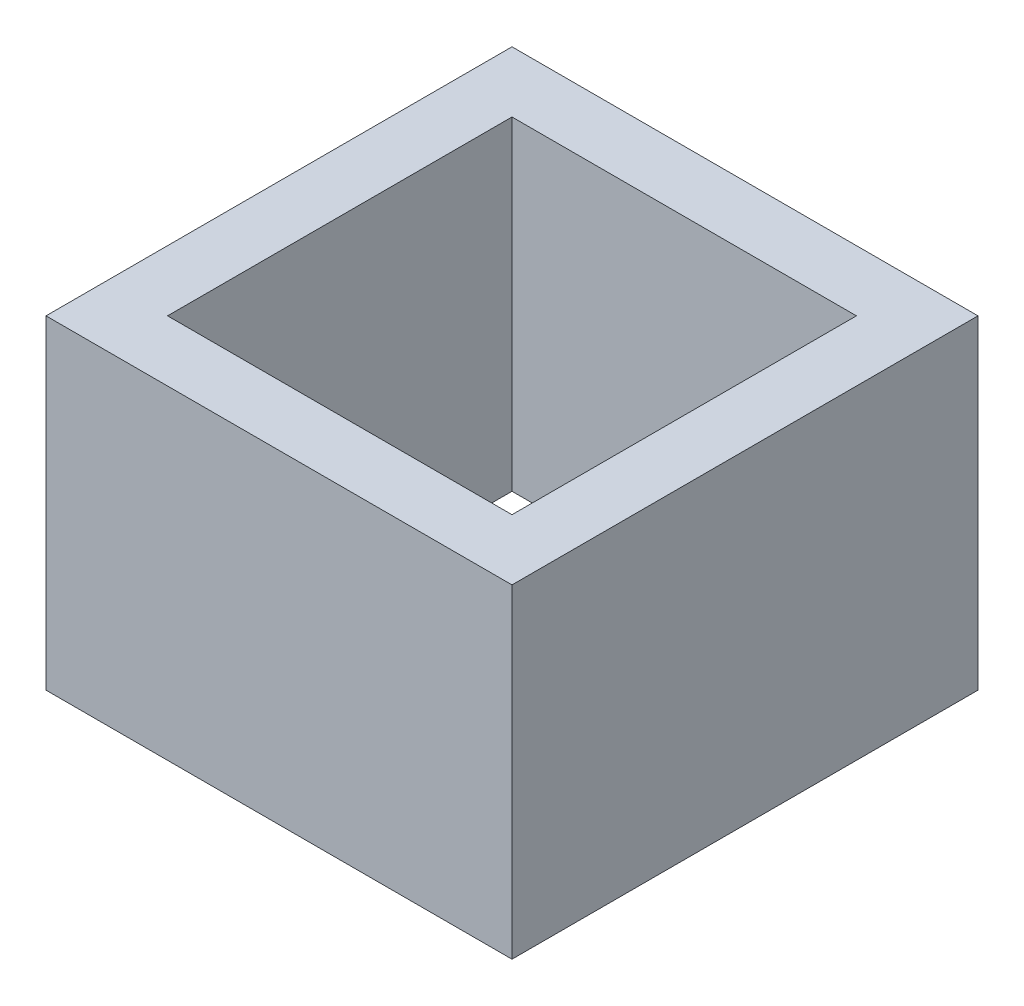
ISO-10303-21;
HEADER;
FILE_DESCRIPTION(('STEP AP214'),'2;1');
FILE_NAME('part.step','',(''),(''),'','','');
FILE_SCHEMA(('AUTOMOTIVE_DESIGN { 1 0 10303 214 1 1 1 1 }'));
ENDSEC;
DATA;
#1=APPLICATION_CONTEXT('core data for automotive mechanical design processes');
#2=APPLICATION_PROTOCOL_DEFINITION('international standard','automotive_design',2000,#1);
#3=PRODUCT_CONTEXT('',#1,'mechanical');
#4=PRODUCT('Part','Part','',(#3));
#5=PRODUCT_RELATED_PRODUCT_CATEGORY('part','',(#4));
#6=PRODUCT_DEFINITION_FORMATION('','',#4);
#7=PRODUCT_DEFINITION_CONTEXT('part definition',#1,'design');
#8=PRODUCT_DEFINITION('design','',#6,#7);
#9=PRODUCT_DEFINITION_SHAPE('','',#8);
#10=(LENGTH_UNIT() NAMED_UNIT(*) SI_UNIT(.MILLI.,.METRE.));
#11=(NAMED_UNIT(*) PLANE_ANGLE_UNIT() SI_UNIT($,.RADIAN.));
#12=(NAMED_UNIT(*) SI_UNIT($,.STERADIAN.) SOLID_ANGLE_UNIT());
#13=UNCERTAINTY_MEASURE_WITH_UNIT(LENGTH_MEASURE(1.E-05),#10,'distance_accuracy_value','');
#14=(GEOMETRIC_REPRESENTATION_CONTEXT(3) GLOBAL_UNCERTAINTY_ASSIGNED_CONTEXT((#13)) GLOBAL_UNIT_ASSIGNED_CONTEXT((#10,
#11,#12)) REPRESENTATION_CONTEXT('',''));
#15=CARTESIAN_POINT('',(0.,0.,0.));
#16=DIRECTION('',(0.,0.,1.));
#17=DIRECTION('',(1.,0.,0.));
#18=AXIS2_PLACEMENT_3D('',#15,#16,#17);
#19=CARTESIAN_POINT('',(0.,8.,0.));
#20=DIRECTION('',(0.,1.,0.));
#21=DIRECTION('',(0.,0.,1.));
#22=AXIS2_PLACEMENT_3D('',#19,#20,#21);
#23=PLANE('',#22);
#24=DIRECTION('',(0.,0.,1.));
#25=VECTOR('',#24,1.);
#26=CARTESIAN_POINT('',(-5.75,8.,5.75));
#27=LINE('',#26,#25);
#28=CARTESIAN_POINT('',(-5.75,8.,-5.75));
#29=VERTEX_POINT('',#28);
#30=CARTESIAN_POINT('',(-5.75,8.,5.75));
#31=VERTEX_POINT('',#30);
#32=EDGE_CURVE('E138',#29,#31,#27,.T.);
#33=ORIENTED_EDGE('',*,*,#32,.T.);
#34=DIRECTION('',(1.,0.,0.));
#35=VECTOR('',#34,1.);
#36=CARTESIAN_POINT('',(5.75,8.,5.75));
#37=LINE('',#36,#35);
#38=CARTESIAN_POINT('',(5.75,8.,5.75));
#39=VERTEX_POINT('',#38);
#40=EDGE_CURVE('E141',#31,#39,#37,.T.);
#41=ORIENTED_EDGE('',*,*,#40,.T.);
#42=DIRECTION('',(0.,0.,-1.));
#43=VECTOR('',#42,1.);
#44=CARTESIAN_POINT('',(5.75,8.,5.75));
#45=LINE('',#44,#43);
#46=CARTESIAN_POINT('',(5.75,8.,-5.75));
#47=VERTEX_POINT('',#46);
#48=EDGE_CURVE('E144',#39,#47,#45,.T.);
#49=ORIENTED_EDGE('',*,*,#48,.T.);
#50=DIRECTION('',(-1.,0.,0.));
#51=VECTOR('',#50,1.);
#52=CARTESIAN_POINT('',(5.75,8.,-5.75));
#53=LINE('',#52,#51);
#54=EDGE_CURVE('E146',#47,#29,#53,.T.);
#55=ORIENTED_EDGE('',*,*,#54,.T.);
#56=EDGE_LOOP('',(#33,#41,#49,#55));
#57=FACE_BOUND('',#56,.T.);
#58=DIRECTION('',(1.,0.,0.));
#59=VECTOR('',#58,1.);
#60=CARTESIAN_POINT('',(4.25,8.,4.25));
#61=LINE('',#60,#59);
#62=CARTESIAN_POINT('',(-4.25,8.,4.25));
#63=VERTEX_POINT('',#62);
#64=CARTESIAN_POINT('',(4.25,8.,4.25));
#65=VERTEX_POINT('',#64);
#66=EDGE_CURVE('E110',#63,#65,#61,.T.);
#67=ORIENTED_EDGE('',*,*,#66,.F.);
#68=DIRECTION('',(0.,0.,1.));
#69=VECTOR('',#68,1.);
#70=CARTESIAN_POINT('',(-4.25,8.,4.25));
#71=LINE('',#70,#69);
#72=CARTESIAN_POINT('',(-4.25,8.,-4.25));
#73=VERTEX_POINT('',#72);
#74=EDGE_CURVE('E102',#73,#63,#71,.T.);
#75=ORIENTED_EDGE('',*,*,#74,.F.);
#76=DIRECTION('',(-1.,0.,0.));
#77=VECTOR('',#76,1.);
#78=CARTESIAN_POINT('',(4.25,8.,-4.25));
#79=LINE('',#78,#77);
#80=CARTESIAN_POINT('',(4.25,8.,-4.25));
#81=VERTEX_POINT('',#80);
#82=EDGE_CURVE('E124',#81,#73,#79,.T.);
#83=ORIENTED_EDGE('',*,*,#82,.F.);
#84=DIRECTION('',(0.,0.,-1.));
#85=VECTOR('',#84,1.);
#86=CARTESIAN_POINT('',(4.25,8.,4.25));
#87=LINE('',#86,#85);
#88=EDGE_CURVE('E122',#65,#81,#87,.T.);
#89=ORIENTED_EDGE('',*,*,#88,.F.);
#90=EDGE_LOOP('',(#67,#75,#83,#89));
#91=FACE_BOUND('',#90,.T.);
#92=ADVANCED_FACE('F37',(#57,#91),#23,.T.);
#93=CARTESIAN_POINT('',(0.,0.,0.));
#94=DIRECTION('',(0.,1.,0.));
#95=DIRECTION('',(0.,0.,1.));
#96=AXIS2_PLACEMENT_3D('',#93,#94,#95);
#97=PLANE('',#96);
#98=DIRECTION('',(0.,0.,1.));
#99=VECTOR('',#98,1.);
#100=CARTESIAN_POINT('',(-5.75,0.,5.75));
#101=LINE('',#100,#99);
#102=CARTESIAN_POINT('',(-5.75,0.,-5.75));
#103=VERTEX_POINT('',#102);
#104=CARTESIAN_POINT('',(-5.75,0.,5.75));
#105=VERTEX_POINT('',#104);
#106=EDGE_CURVE('E118',#103,#105,#101,.T.);
#107=ORIENTED_EDGE('',*,*,#106,.F.);
#108=DIRECTION('',(-1.,0.,0.));
#109=VECTOR('',#108,1.);
#110=CARTESIAN_POINT('',(5.75,0.,-5.75));
#111=LINE('',#110,#109);
#112=CARTESIAN_POINT('',(5.75,0.,-5.75));
#113=VERTEX_POINT('',#112);
#114=EDGE_CURVE('E142',#113,#103,#111,.T.);
#115=ORIENTED_EDGE('',*,*,#114,.F.);
#116=DIRECTION('',(0.,0.,-1.));
#117=VECTOR('',#116,1.);
#118=CARTESIAN_POINT('',(5.75,0.,5.75));
#119=LINE('',#118,#117);
#120=CARTESIAN_POINT('',(5.75,0.,5.75));
#121=VERTEX_POINT('',#120);
#122=EDGE_CURVE('E153',#121,#113,#119,.T.);
#123=ORIENTED_EDGE('',*,*,#122,.F.);
#124=DIRECTION('',(1.,0.,0.));
#125=VECTOR('',#124,1.);
#126=CARTESIAN_POINT('',(5.75,0.,5.75));
#127=LINE('',#126,#125);
#128=EDGE_CURVE('E151',#105,#121,#127,.T.);
#129=ORIENTED_EDGE('',*,*,#128,.F.);
#130=EDGE_LOOP('',(#107,#115,#123,#129));
#131=FACE_BOUND('',#130,.T.);
#132=DIRECTION('',(0.,0.,1.));
#133=VECTOR('',#132,1.);
#134=CARTESIAN_POINT('',(-4.25,0.,4.25));
#135=LINE('',#134,#133);
#136=CARTESIAN_POINT('',(-4.25,0.,-4.25));
#137=VERTEX_POINT('',#136);
#138=CARTESIAN_POINT('',(-4.25,0.,4.25));
#139=VERTEX_POINT('',#138);
#140=EDGE_CURVE('E60',#137,#139,#135,.T.);
#141=ORIENTED_EDGE('',*,*,#140,.T.);
#142=DIRECTION('',(1.,0.,0.));
#143=VECTOR('',#142,1.);
#144=CARTESIAN_POINT('',(4.25,0.,4.25));
#145=LINE('',#144,#143);
#146=CARTESIAN_POINT('',(4.25,0.,4.25));
#147=VERTEX_POINT('',#146);
#148=EDGE_CURVE('E117',#139,#147,#145,.T.);
#149=ORIENTED_EDGE('',*,*,#148,.T.);
#150=DIRECTION('',(0.,0.,-1.));
#151=VECTOR('',#150,1.);
#152=CARTESIAN_POINT('',(4.25,0.,4.25));
#153=LINE('',#152,#151);
#154=CARTESIAN_POINT('',(4.25,0.,-4.25));
#155=VERTEX_POINT('',#154);
#156=EDGE_CURVE('E130',#147,#155,#153,.T.);
#157=ORIENTED_EDGE('',*,*,#156,.T.);
#158=DIRECTION('',(-1.,0.,0.));
#159=VECTOR('',#158,1.);
#160=CARTESIAN_POINT('',(4.25,0.,-4.25));
#161=LINE('',#160,#159);
#162=EDGE_CURVE('E111',#155,#137,#161,.T.);
#163=ORIENTED_EDGE('',*,*,#162,.T.);
#164=EDGE_LOOP('',(#141,#149,#157,#163));
#165=FACE_BOUND('',#164,.T.);
#166=ADVANCED_FACE('F171',(#131,#165),#97,.F.);
#167=CARTESIAN_POINT('',(-5.75,8.,5.75));
#168=DIRECTION('',(1.,0.,0.));
#169=DIRECTION('',(0.,0.,-1.));
#170=AXIS2_PLACEMENT_3D('',#167,#168,#169);
#171=PLANE('',#170);
#172=ORIENTED_EDGE('',*,*,#106,.T.);
#173=DIRECTION('',(0.,-1.,0.));
#174=VECTOR('',#173,1.);
#175=CARTESIAN_POINT('',(-5.75,8.,5.75));
#176=LINE('',#175,#174);
#177=EDGE_CURVE('E11',#31,#105,#176,.T.);
#178=ORIENTED_EDGE('',*,*,#177,.F.);
#179=ORIENTED_EDGE('',*,*,#32,.F.);
#180=DIRECTION('',(0.,-1.,0.));
#181=VECTOR('',#180,1.);
#182=CARTESIAN_POINT('',(-5.75,8.,-5.75));
#183=LINE('',#182,#181);
#184=EDGE_CURVE('E148',#29,#103,#183,.T.);
#185=ORIENTED_EDGE('',*,*,#184,.T.);
#186=EDGE_LOOP('',(#172,#178,#179,#185));
#187=FACE_BOUND('',#186,.T.);
#188=ADVANCED_FACE('F39',(#187),#171,.F.);
#189=CARTESIAN_POINT('',(5.75,8.,5.75));
#190=DIRECTION('',(0.,0.,-1.));
#191=DIRECTION('',(-1.,0.,0.));
#192=AXIS2_PLACEMENT_3D('',#189,#190,#191);
#193=PLANE('',#192);
#194=ORIENTED_EDGE('',*,*,#128,.T.);
#195=DIRECTION('',(0.,-1.,0.));
#196=VECTOR('',#195,1.);
#197=CARTESIAN_POINT('',(5.75,8.,5.75));
#198=LINE('',#197,#196);
#199=EDGE_CURVE('E45',#39,#121,#198,.T.);
#200=ORIENTED_EDGE('',*,*,#199,.F.);
#201=ORIENTED_EDGE('',*,*,#40,.F.);
#202=ORIENTED_EDGE('',*,*,#177,.T.);
#203=EDGE_LOOP('',(#194,#200,#201,#202));
#204=FACE_BOUND('',#203,.T.);
#205=ADVANCED_FACE('F181',(#204),#193,.F.);
#206=CARTESIAN_POINT('',(5.75,8.,5.75));
#207=DIRECTION('',(-1.,0.,0.));
#208=DIRECTION('',(0.,0.,1.));
#209=AXIS2_PLACEMENT_3D('',#206,#207,#208);
#210=PLANE('',#209);
#211=ORIENTED_EDGE('',*,*,#122,.T.);
#212=DIRECTION('',(0.,-1.,0.));
#213=VECTOR('',#212,1.);
#214=CARTESIAN_POINT('',(5.75,8.,-5.75));
#215=LINE('',#214,#213);
#216=EDGE_CURVE('E158',#47,#113,#215,.T.);
#217=ORIENTED_EDGE('',*,*,#216,.F.);
#218=ORIENTED_EDGE('',*,*,#48,.F.);
#219=ORIENTED_EDGE('',*,*,#199,.T.);
#220=EDGE_LOOP('',(#211,#217,#218,#219));
#221=FACE_BOUND('',#220,.T.);
#222=ADVANCED_FACE('F165',(#221),#210,.F.);
#223=CARTESIAN_POINT('',(5.75,8.,-5.75));
#224=DIRECTION('',(0.,0.,1.));
#225=DIRECTION('',(1.,0.,0.));
#226=AXIS2_PLACEMENT_3D('',#223,#224,#225);
#227=PLANE('',#226);
#228=ORIENTED_EDGE('',*,*,#114,.T.);
#229=ORIENTED_EDGE('',*,*,#184,.F.);
#230=ORIENTED_EDGE('',*,*,#54,.F.);
#231=ORIENTED_EDGE('',*,*,#216,.T.);
#232=EDGE_LOOP('',(#228,#229,#230,#231));
#233=FACE_BOUND('',#232,.T.);
#234=ADVANCED_FACE('F175',(#233),#227,.F.);
#235=CARTESIAN_POINT('',(-4.25,8.,4.25));
#236=DIRECTION('',(1.,0.,0.));
#237=DIRECTION('',(0.,0.,-1.));
#238=AXIS2_PLACEMENT_3D('',#235,#236,#237);
#239=PLANE('',#238);
#240=ORIENTED_EDGE('',*,*,#140,.F.);
#241=DIRECTION('',(0.,-1.,0.));
#242=VECTOR('',#241,1.);
#243=CARTESIAN_POINT('',(-4.25,8.,-4.25));
#244=LINE('',#243,#242);
#245=EDGE_CURVE('E106',#73,#137,#244,.T.);
#246=ORIENTED_EDGE('',*,*,#245,.F.);
#247=ORIENTED_EDGE('',*,*,#74,.T.);
#248=DIRECTION('',(0.,-1.,0.));
#249=VECTOR('',#248,1.);
#250=CARTESIAN_POINT('',(-4.25,8.,4.25));
#251=LINE('',#250,#249);
#252=EDGE_CURVE('E105',#63,#139,#251,.T.);
#253=ORIENTED_EDGE('',*,*,#252,.T.);
#254=EDGE_LOOP('',(#240,#246,#247,#253));
#255=FACE_BOUND('',#254,.T.);
#256=ADVANCED_FACE('F104',(#255),#239,.T.);
#257=CARTESIAN_POINT('',(4.25,8.,4.25));
#258=DIRECTION('',(0.,0.,-1.));
#259=DIRECTION('',(-1.,0.,0.));
#260=AXIS2_PLACEMENT_3D('',#257,#258,#259);
#261=PLANE('',#260);
#262=ORIENTED_EDGE('',*,*,#148,.F.);
#263=ORIENTED_EDGE('',*,*,#252,.F.);
#264=ORIENTED_EDGE('',*,*,#66,.T.);
#265=DIRECTION('',(0.,-1.,0.));
#266=VECTOR('',#265,1.);
#267=CARTESIAN_POINT('',(4.25,8.,4.25));
#268=LINE('',#267,#266);
#269=EDGE_CURVE('E119',#65,#147,#268,.T.);
#270=ORIENTED_EDGE('',*,*,#269,.T.);
#271=EDGE_LOOP('',(#262,#263,#264,#270));
#272=FACE_BOUND('',#271,.T.);
#273=ADVANCED_FACE('F114',(#272),#261,.T.);
#274=CARTESIAN_POINT('',(4.25,8.,4.25));
#275=DIRECTION('',(-1.,0.,0.));
#276=DIRECTION('',(0.,0.,1.));
#277=AXIS2_PLACEMENT_3D('',#274,#275,#276);
#278=PLANE('',#277);
#279=ORIENTED_EDGE('',*,*,#156,.F.);
#280=ORIENTED_EDGE('',*,*,#269,.F.);
#281=ORIENTED_EDGE('',*,*,#88,.T.);
#282=DIRECTION('',(0.,-1.,0.));
#283=VECTOR('',#282,1.);
#284=CARTESIAN_POINT('',(4.25,8.,-4.25));
#285=LINE('',#284,#283);
#286=EDGE_CURVE('E52',#81,#155,#285,.T.);
#287=ORIENTED_EDGE('',*,*,#286,.T.);
#288=EDGE_LOOP('',(#279,#280,#281,#287));
#289=FACE_BOUND('',#288,.T.);
#290=ADVANCED_FACE('F204',(#289),#278,.T.);
#291=CARTESIAN_POINT('',(4.25,8.,-4.25));
#292=DIRECTION('',(0.,0.,1.));
#293=DIRECTION('',(1.,0.,0.));
#294=AXIS2_PLACEMENT_3D('',#291,#292,#293);
#295=PLANE('',#294);
#296=ORIENTED_EDGE('',*,*,#162,.F.);
#297=ORIENTED_EDGE('',*,*,#286,.F.);
#298=ORIENTED_EDGE('',*,*,#82,.T.);
#299=ORIENTED_EDGE('',*,*,#245,.T.);
#300=EDGE_LOOP('',(#296,#297,#298,#299));
#301=FACE_BOUND('',#300,.T.);
#302=ADVANCED_FACE('F208',(#301),#295,.T.);
#303=CLOSED_SHELL('',(#92,#166,#188,#205,#222,#234,#256,#273,#290,#302));
#304=MANIFOLD_SOLID_BREP('B2',#303);
#305=ADVANCED_BREP_SHAPE_REPRESENTATION('',(#18,#304),#14);
#306=SHAPE_DEFINITION_REPRESENTATION(#9,#305);
ENDSEC;
END-ISO-10303-21;
